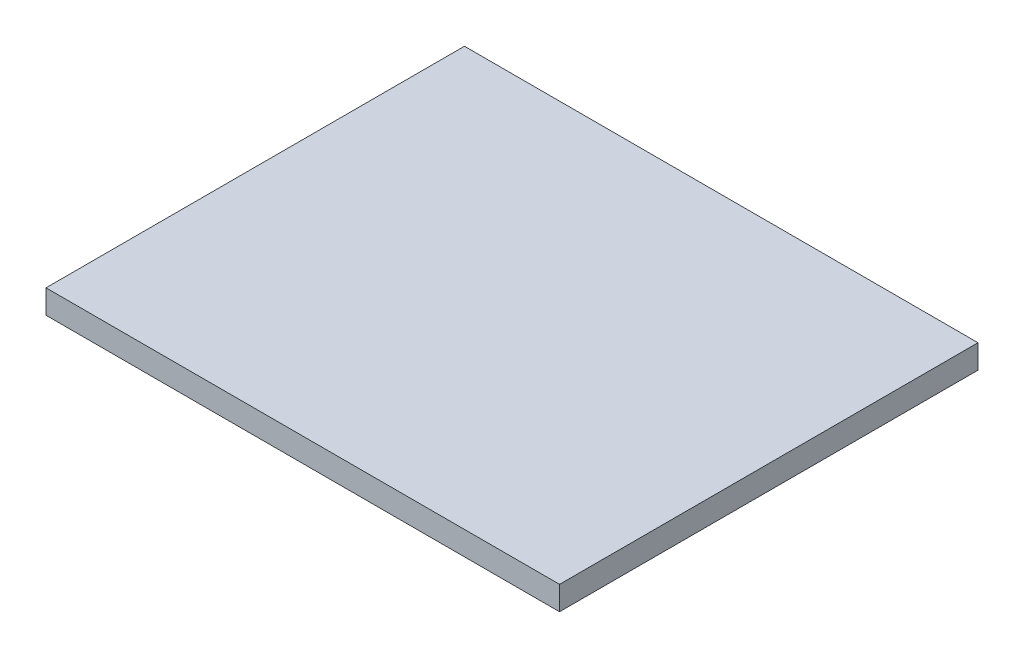
ISO-10303-21;
HEADER;
FILE_DESCRIPTION(('STEP AP214'),'2;1');
FILE_NAME('part.step','',(''),(''),'','','');
FILE_SCHEMA(('AUTOMOTIVE_DESIGN { 1 0 10303 214 1 1 1 1 }'));
ENDSEC;
DATA;
#1=APPLICATION_CONTEXT('core data for automotive mechanical design processes');
#2=APPLICATION_PROTOCOL_DEFINITION('international standard','automotive_design',2000,#1);
#3=PRODUCT_CONTEXT('',#1,'mechanical');
#4=PRODUCT('Part','Part','',(#3));
#5=PRODUCT_RELATED_PRODUCT_CATEGORY('part','',(#4));
#6=PRODUCT_DEFINITION_FORMATION('','',#4);
#7=PRODUCT_DEFINITION_CONTEXT('part definition',#1,'design');
#8=PRODUCT_DEFINITION('design','',#6,#7);
#9=PRODUCT_DEFINITION_SHAPE('','',#8);
#10=(LENGTH_UNIT() NAMED_UNIT(*) SI_UNIT(.MILLI.,.METRE.));
#11=(NAMED_UNIT(*) PLANE_ANGLE_UNIT() SI_UNIT($,.RADIAN.));
#12=(NAMED_UNIT(*) SI_UNIT($,.STERADIAN.) SOLID_ANGLE_UNIT());
#13=UNCERTAINTY_MEASURE_WITH_UNIT(LENGTH_MEASURE(1.E-05),#10,'distance_accuracy_value','');
#14=(GEOMETRIC_REPRESENTATION_CONTEXT(3) GLOBAL_UNCERTAINTY_ASSIGNED_CONTEXT((#13)) GLOBAL_UNIT_ASSIGNED_CONTEXT((#10,
#11,#12)) REPRESENTATION_CONTEXT('',''));
#15=CARTESIAN_POINT('',(0.,0.,0.));
#16=DIRECTION('',(0.,0.,1.));
#17=DIRECTION('',(1.,0.,0.));
#18=AXIS2_PLACEMENT_3D('',#15,#16,#17);
#19=CARTESIAN_POINT('',(64.8,-100.,117.669407273383));
#20=DIRECTION('',(-1.,0.,0.));
#21=DIRECTION('',(0.,0.,1.));
#22=AXIS2_PLACEMENT_3D('',#19,#20,#21);
#23=PLANE('',#22);
#24=DIRECTION('',(0.,1.,0.));
#25=VECTOR('',#24,1.);
#26=CARTESIAN_POINT('',(64.8,-100.,52.7999999999999));
#27=LINE('',#26,#25);
#28=CARTESIAN_POINT('',(64.8,-103.,52.7999999999999));
#29=VERTEX_POINT('',#28);
#30=CARTESIAN_POINT('',(64.8,-100.,52.7999999999999));
#31=VERTEX_POINT('',#30);
#32=EDGE_CURVE('E84',#29,#31,#27,.T.);
#33=ORIENTED_EDGE('',*,*,#32,.F.);
#34=DIRECTION('',(0.,0.,-1.));
#35=VECTOR('',#34,1.);
#36=CARTESIAN_POINT('',(64.8,-103.,117.669407273383));
#37=LINE('',#36,#35);
#38=CARTESIAN_POINT('',(64.8,-103.,0.));
#39=VERTEX_POINT('',#38);
#40=EDGE_CURVE('E37',#29,#39,#37,.T.);
#41=ORIENTED_EDGE('',*,*,#40,.T.);
#42=DIRECTION('',(0.,1.,0.));
#43=VECTOR('',#42,1.);
#44=CARTESIAN_POINT('',(64.8,-100.,0.));
#45=LINE('',#44,#43);
#46=CARTESIAN_POINT('',(64.8,-100.,0.));
#47=VERTEX_POINT('',#46);
#48=EDGE_CURVE('E82',#39,#47,#45,.T.);
#49=ORIENTED_EDGE('',*,*,#48,.T.);
#50=DIRECTION('',(0.,0.,-1.));
#51=VECTOR('',#50,1.);
#52=CARTESIAN_POINT('',(64.8,-100.,117.669407273383));
#53=LINE('',#52,#51);
#54=EDGE_CURVE('E72',#31,#47,#53,.T.);
#55=ORIENTED_EDGE('',*,*,#54,.F.);
#56=EDGE_LOOP('',(#33,#41,#49,#55));
#57=FACE_BOUND('',#56,.T.);
#58=ADVANCED_FACE('F33',(#57),#23,.F.);
#59=CARTESIAN_POINT('',(64.8,-100.,117.669407273383));
#60=DIRECTION('',(0.,-1.,0.));
#61=DIRECTION('',(0.,0.,-1.));
#62=AXIS2_PLACEMENT_3D('',#59,#60,#61);
#63=PLANE('',#62);
#64=DIRECTION('',(1.,0.,0.));
#65=VECTOR('',#64,1.);
#66=CARTESIAN_POINT('',(43.4028600011032,-100.,52.7999999999999));
#67=LINE('',#66,#65);
#68=CARTESIAN_POINT('',(0.,-100.,52.7999999999999));
#69=VERTEX_POINT('',#68);
#70=EDGE_CURVE('E78',#69,#31,#67,.T.);
#71=ORIENTED_EDGE('',*,*,#70,.T.);
#72=ORIENTED_EDGE('',*,*,#54,.T.);
#73=DIRECTION('',(-1.,0.,0.));
#74=VECTOR('',#73,1.);
#75=CARTESIAN_POINT('',(64.8,-100.,0.));
#76=LINE('',#75,#74);
#77=CARTESIAN_POINT('',(0.,-100.,0.));
#78=VERTEX_POINT('',#77);
#79=EDGE_CURVE('E92',#47,#78,#76,.T.);
#80=ORIENTED_EDGE('',*,*,#79,.T.);
#81=DIRECTION('',(0.,0.,-1.));
#82=VECTOR('',#81,1.);
#83=CARTESIAN_POINT('',(0.,-100.,117.669407273383));
#84=LINE('',#83,#82);
#85=EDGE_CURVE('E101',#69,#78,#84,.T.);
#86=ORIENTED_EDGE('',*,*,#85,.F.);
#87=EDGE_LOOP('',(#71,#72,#80,#86));
#88=FACE_BOUND('',#87,.T.);
#89=ADVANCED_FACE('F106',(#88),#63,.F.);
#90=CARTESIAN_POINT('',(0.,-100.,117.669407273383));
#91=DIRECTION('',(1.,0.,0.));
#92=DIRECTION('',(0.,1.,0.));
#93=AXIS2_PLACEMENT_3D('',#90,#91,#92);
#94=PLANE('',#93);
#95=DIRECTION('',(0.,-1.,0.));
#96=VECTOR('',#95,1.);
#97=CARTESIAN_POINT('',(-1.04083408558608E-13,-2.22044604925031E-13,52.7999999999999));
#98=LINE('',#97,#96);
#99=CARTESIAN_POINT('',(0.,-103.,52.7999999999999));
#100=VERTEX_POINT('',#99);
#101=EDGE_CURVE('E42',#69,#100,#98,.T.);
#102=ORIENTED_EDGE('',*,*,#101,.F.);
#103=ORIENTED_EDGE('',*,*,#85,.T.);
#104=DIRECTION('',(0.,-1.,0.));
#105=VECTOR('',#104,1.);
#106=CARTESIAN_POINT('',(0.,-100.,0.));
#107=LINE('',#106,#105);
#108=CARTESIAN_POINT('',(0.,-103.,0.));
#109=VERTEX_POINT('',#108);
#110=EDGE_CURVE('E103',#78,#109,#107,.T.);
#111=ORIENTED_EDGE('',*,*,#110,.T.);
#112=DIRECTION('',(0.,0.,-1.));
#113=VECTOR('',#112,1.);
#114=CARTESIAN_POINT('',(0.,-103.,117.669407273383));
#115=LINE('',#114,#113);
#116=EDGE_CURVE('E55',#100,#109,#115,.T.);
#117=ORIENTED_EDGE('',*,*,#116,.F.);
#118=EDGE_LOOP('',(#102,#103,#111,#117));
#119=FACE_BOUND('',#118,.T.);
#120=ADVANCED_FACE('F105',(#119),#94,.F.);
#121=CARTESIAN_POINT('',(64.8,-103.,117.669407273383));
#122=DIRECTION('',(0.,1.,0.));
#123=DIRECTION('',(0.,0.,1.));
#124=AXIS2_PLACEMENT_3D('',#121,#122,#123);
#125=PLANE('',#124);
#126=DIRECTION('',(1.,0.,0.));
#127=VECTOR('',#126,1.);
#128=CARTESIAN_POINT('',(64.8,-103.,52.7999999999999));
#129=LINE('',#128,#127);
#130=EDGE_CURVE('E11',#100,#29,#129,.T.);
#131=ORIENTED_EDGE('',*,*,#130,.F.);
#132=ORIENTED_EDGE('',*,*,#116,.T.);
#133=DIRECTION('',(1.,0.,0.));
#134=VECTOR('',#133,1.);
#135=CARTESIAN_POINT('',(64.8,-103.,0.));
#136=LINE('',#135,#134);
#137=EDGE_CURVE('E86',#109,#39,#136,.T.);
#138=ORIENTED_EDGE('',*,*,#137,.T.);
#139=ORIENTED_EDGE('',*,*,#40,.F.);
#140=EDGE_LOOP('',(#131,#132,#138,#139));
#141=FACE_BOUND('',#140,.T.);
#142=ADVANCED_FACE('F87',(#141),#125,.F.);
#143=CARTESIAN_POINT('',(0.,0.,0.));
#144=DIRECTION('',(0.,0.,-1.));
#145=DIRECTION('',(-1.,0.,0.));
#146=AXIS2_PLACEMENT_3D('',#143,#144,#145);
#147=PLANE('',#146);
#148=ORIENTED_EDGE('',*,*,#48,.F.);
#149=ORIENTED_EDGE('',*,*,#137,.F.);
#150=ORIENTED_EDGE('',*,*,#110,.F.);
#151=ORIENTED_EDGE('',*,*,#79,.F.);
#152=EDGE_LOOP('',(#148,#149,#150,#151));
#153=FACE_BOUND('',#152,.T.);
#154=ADVANCED_FACE('F91',(#153),#147,.T.);
#155=CARTESIAN_POINT('',(-9.43689570931383E-13,69.0000000000024,52.7999999999999));
#156=DIRECTION('',(0.,0.,1.));
#157=DIRECTION('',(1.,0.,0.));
#158=AXIS2_PLACEMENT_3D('',#155,#156,#157);
#159=PLANE('',#158);
#160=ORIENTED_EDGE('',*,*,#32,.T.);
#161=ORIENTED_EDGE('',*,*,#70,.F.);
#162=ORIENTED_EDGE('',*,*,#101,.T.);
#163=ORIENTED_EDGE('',*,*,#130,.T.);
#164=EDGE_LOOP('',(#160,#161,#162,#163));
#165=FACE_BOUND('',#164,.T.);
#166=ADVANCED_FACE('F35',(#165),#159,.T.);
#167=CLOSED_SHELL('',(#58,#89,#120,#142,#154,#166));
#168=MANIFOLD_SOLID_BREP('B2',#167);
#169=ADVANCED_BREP_SHAPE_REPRESENTATION('',(#18,#168),#14);
#170=SHAPE_DEFINITION_REPRESENTATION(#9,#169);
ENDSEC;
END-ISO-10303-21;
